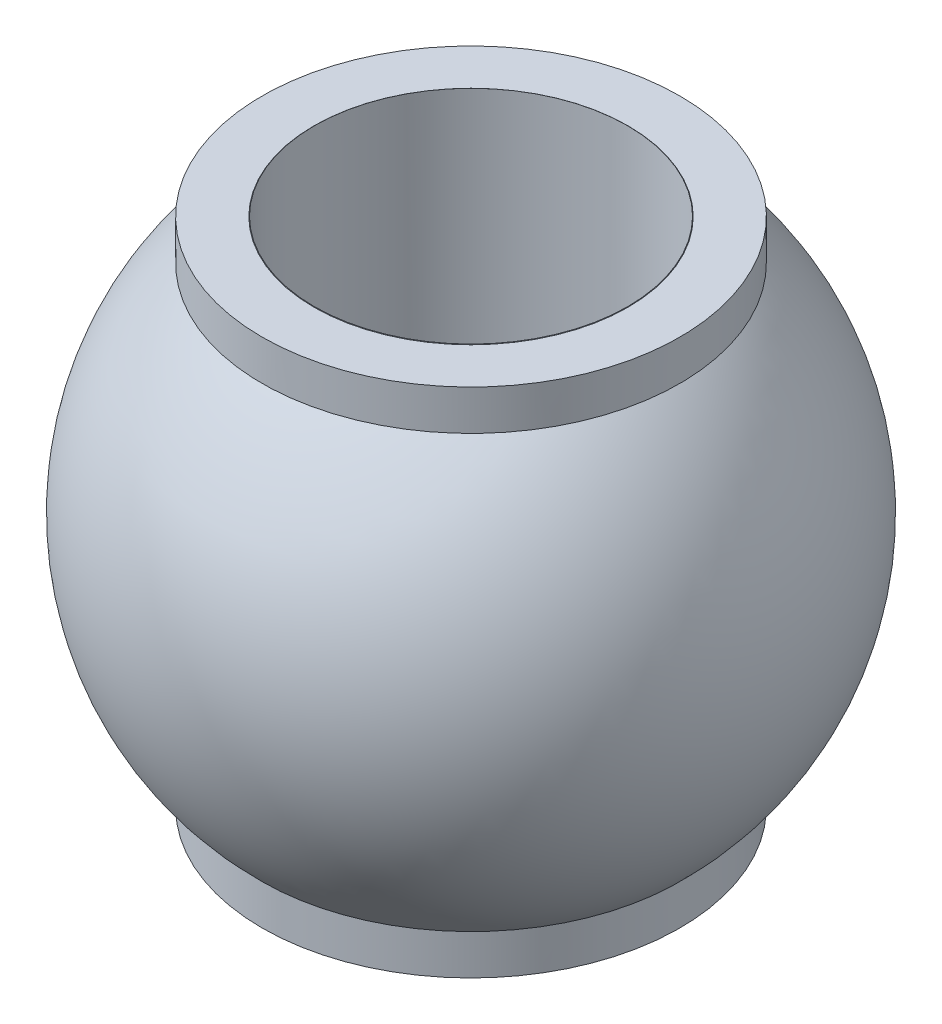
ISO-10303-21;
HEADER;
FILE_DESCRIPTION(('STEP AP214'),'2;1');
FILE_NAME('part.step','',(''),(''),'','','');
FILE_SCHEMA(('AUTOMOTIVE_DESIGN { 1 0 10303 214 1 1 1 1 }'));
ENDSEC;
DATA;
#1=APPLICATION_CONTEXT('core data for automotive mechanical design processes');
#2=APPLICATION_PROTOCOL_DEFINITION('international standard','automotive_design',2000,#1);
#3=PRODUCT_CONTEXT('',#1,'mechanical');
#4=PRODUCT('Part','Part','',(#3));
#5=PRODUCT_RELATED_PRODUCT_CATEGORY('part','',(#4));
#6=PRODUCT_DEFINITION_FORMATION('','',#4);
#7=PRODUCT_DEFINITION_CONTEXT('part definition',#1,'design');
#8=PRODUCT_DEFINITION('design','',#6,#7);
#9=PRODUCT_DEFINITION_SHAPE('','',#8);
#10=(LENGTH_UNIT() NAMED_UNIT(*) SI_UNIT(.MILLI.,.METRE.));
#11=(NAMED_UNIT(*) PLANE_ANGLE_UNIT() SI_UNIT($,.RADIAN.));
#12=(NAMED_UNIT(*) SI_UNIT($,.STERADIAN.) SOLID_ANGLE_UNIT());
#13=UNCERTAINTY_MEASURE_WITH_UNIT(LENGTH_MEASURE(1.E-05),#10,'distance_accuracy_value','');
#14=(GEOMETRIC_REPRESENTATION_CONTEXT(3) GLOBAL_UNCERTAINTY_ASSIGNED_CONTEXT((#13)) GLOBAL_UNIT_ASSIGNED_CONTEXT((#10,
#11,#12)) REPRESENTATION_CONTEXT('',''));
#15=CARTESIAN_POINT('',(0.,0.,0.));
#16=DIRECTION('',(0.,0.,1.));
#17=DIRECTION('',(1.,0.,0.));
#18=AXIS2_PLACEMENT_3D('',#15,#16,#17);
#19=CARTESIAN_POINT('',(0.,0.,0.));
#20=DIRECTION('',(0.,1.,0.));
#21=DIRECTION('',(1.,0.,0.));
#22=AXIS2_PLACEMENT_3D('',#19,#20,#21);
#23=SPHERICAL_SURFACE('',#22,2.875);
#24=CARTESIAN_POINT('',(0.,2.45267710879357,0.));
#25=DIRECTION('',(0.,-1.,0.));
#26=DIRECTION('',(0.,0.,-1.));
#27=AXIS2_PLACEMENT_3D('',#24,#25,#26);
#28=CIRCLE('',#27,1.5);
#29=CARTESIAN_POINT('',(0.,2.45267710879357,-1.5));
#30=VERTEX_POINT('',#29);
#31=EDGE_CURVE('E62',#30,#30,#28,.F.);
#32=ORIENTED_EDGE('',*,*,#31,.F.);
#33=EDGE_LOOP('',(#32));
#34=FACE_BOUND('',#33,.T.);
#35=CARTESIAN_POINT('',(0.,2.45,0.));
#36=DIRECTION('',(0.,1.,0.));
#37=DIRECTION('',(0.,0.,1.));
#38=AXIS2_PLACEMENT_3D('',#35,#36,#37);
#39=CIRCLE('',#38,1.50436863833304);
#40=CARTESIAN_POINT('',(0.,2.45,1.50436863833304));
#41=VERTEX_POINT('',#40);
#42=EDGE_CURVE('E10',#41,#41,#39,.F.);
#43=ORIENTED_EDGE('',*,*,#42,.F.);
#44=EDGE_LOOP('',(#43));
#45=FACE_BOUND('',#44,.T.);
#46=ADVANCED_FACE('F39',(#34,#45),#23,.T.);
#47=CARTESIAN_POINT('',(0.,2.45,0.));
#48=DIRECTION('',(0.,-1.,0.));
#49=DIRECTION('',(0.,0.,-1.));
#50=AXIS2_PLACEMENT_3D('',#47,#48,#49);
#51=CYLINDRICAL_SURFACE('',#50,2.);
#52=CARTESIAN_POINT('',(0.,2.06533895523229,0.));
#53=DIRECTION('',(0.,-1.,0.));
#54=DIRECTION('',(0.,0.,-1.));
#55=AXIS2_PLACEMENT_3D('',#52,#53,#54);
#56=CIRCLE('',#55,2.);
#57=CARTESIAN_POINT('',(0.,2.06533895523229,-2.));
#58=VERTEX_POINT('',#57);
#59=EDGE_CURVE('E55',#58,#58,#56,.T.);
#60=ORIENTED_EDGE('',*,*,#59,.F.);
#61=EDGE_LOOP('',(#60));
#62=FACE_BOUND('',#61,.T.);
#63=CARTESIAN_POINT('',(0.,2.45,0.));
#64=DIRECTION('',(0.,1.,0.));
#65=DIRECTION('',(0.,0.,1.));
#66=AXIS2_PLACEMENT_3D('',#63,#64,#65);
#67=CIRCLE('',#66,2.);
#68=CARTESIAN_POINT('',(0.,2.45,2.));
#69=VERTEX_POINT('',#68);
#70=EDGE_CURVE('E58',#69,#69,#67,.T.);
#71=ORIENTED_EDGE('',*,*,#70,.F.);
#72=EDGE_LOOP('',(#71));
#73=FACE_BOUND('',#72,.T.);
#74=ADVANCED_FACE('F88',(#62,#73),#51,.T.);
#75=CARTESIAN_POINT('',(0.,2.45,0.));
#76=DIRECTION('',(0.,1.,0.));
#77=DIRECTION('',(0.,0.,1.));
#78=AXIS2_PLACEMENT_3D('',#75,#76,#77);
#79=PLANE('',#78);
#80=ORIENTED_EDGE('',*,*,#42,.T.);
#81=EDGE_LOOP('',(#80));
#82=FACE_BOUND('',#81,.T.);
#83=ORIENTED_EDGE('',*,*,#70,.T.);
#84=EDGE_LOOP('',(#83));
#85=FACE_BOUND('',#84,.T.);
#86=ADVANCED_FACE('F92',(#82,#85),#79,.T.);
#87=ORIENTED_EDGE('',*,*,#59,.T.);
#88=EDGE_LOOP('',(#87));
#89=FACE_BOUND('',#88,.T.);
#90=CARTESIAN_POINT('',(0.,-2.06533895523229,0.));
#91=DIRECTION('',(0.,1.,0.));
#92=DIRECTION('',(0.,0.,1.));
#93=AXIS2_PLACEMENT_3D('',#90,#91,#92);
#94=CIRCLE('',#93,2.);
#95=CARTESIAN_POINT('',(0.,-2.06533895523229,2.));
#96=VERTEX_POINT('',#95);
#97=EDGE_CURVE('E50',#96,#96,#94,.T.);
#98=ORIENTED_EDGE('',*,*,#97,.T.);
#99=EDGE_LOOP('',(#98));
#100=FACE_BOUND('',#99,.T.);
#101=ADVANCED_FACE('F77',(#89,#100),#23,.T.);
#102=ORIENTED_EDGE('',*,*,#97,.F.);
#103=EDGE_LOOP('',(#102));
#104=FACE_BOUND('',#103,.T.);
#105=CARTESIAN_POINT('',(0.,-2.45,0.));
#106=DIRECTION('',(0.,1.,0.));
#107=DIRECTION('',(0.,0.,1.));
#108=AXIS2_PLACEMENT_3D('',#105,#106,#107);
#109=CIRCLE('',#108,2.);
#110=CARTESIAN_POINT('',(0.,-2.45,2.));
#111=VERTEX_POINT('',#110);
#112=EDGE_CURVE('E59',#111,#111,#109,.T.);
#113=ORIENTED_EDGE('',*,*,#112,.T.);
#114=EDGE_LOOP('',(#113));
#115=FACE_BOUND('',#114,.T.);
#116=ADVANCED_FACE('F82',(#104,#115),#51,.T.);
#117=CARTESIAN_POINT('',(0.,-2.45,0.));
#118=DIRECTION('',(0.,1.,0.));
#119=DIRECTION('',(0.,0.,1.));
#120=AXIS2_PLACEMENT_3D('',#117,#118,#119);
#121=PLANE('',#120);
#122=CARTESIAN_POINT('',(0.,-2.45,0.));
#123=DIRECTION('',(0.,1.,0.));
#124=DIRECTION('',(0.,0.,1.));
#125=AXIS2_PLACEMENT_3D('',#122,#123,#124);
#126=CIRCLE('',#125,1.50436863833304);
#127=CARTESIAN_POINT('',(0.,-2.45,1.50436863833304));
#128=VERTEX_POINT('',#127);
#129=EDGE_CURVE('E46',#128,#128,#126,.F.);
#130=ORIENTED_EDGE('',*,*,#129,.F.);
#131=EDGE_LOOP('',(#130));
#132=FACE_BOUND('',#131,.T.);
#133=ORIENTED_EDGE('',*,*,#112,.F.);
#134=EDGE_LOOP('',(#133));
#135=FACE_BOUND('',#134,.T.);
#136=ADVANCED_FACE('F76',(#132,#135),#121,.F.);
#137=CARTESIAN_POINT('',(0.,-2.45267710879357,0.));
#138=DIRECTION('',(0.,1.,0.));
#139=DIRECTION('',(0.,0.,1.));
#140=AXIS2_PLACEMENT_3D('',#137,#138,#139);
#141=CIRCLE('',#140,1.5);
#142=CARTESIAN_POINT('',(0.,-2.45267710879357,1.5));
#143=VERTEX_POINT('',#142);
#144=EDGE_CURVE('E42',#143,#143,#141,.F.);
#145=ORIENTED_EDGE('',*,*,#144,.F.);
#146=EDGE_LOOP('',(#145));
#147=FACE_BOUND('',#146,.T.);
#148=ORIENTED_EDGE('',*,*,#129,.T.);
#149=EDGE_LOOP('',(#148));
#150=FACE_BOUND('',#149,.T.);
#151=ADVANCED_FACE('F73',(#147,#150),#23,.T.);
#152=CARTESIAN_POINT('',(0.,-3.,0.));
#153=DIRECTION('',(0.,1.,0.));
#154=DIRECTION('',(0.,0.,1.));
#155=AXIS2_PLACEMENT_3D('',#152,#153,#154);
#156=CYLINDRICAL_SURFACE('',#155,1.5);
#157=ORIENTED_EDGE('',*,*,#31,.T.);
#158=EDGE_LOOP('',(#157));
#159=FACE_BOUND('',#158,.T.);
#160=ORIENTED_EDGE('',*,*,#144,.T.);
#161=EDGE_LOOP('',(#160));
#162=FACE_BOUND('',#161,.T.);
#163=ADVANCED_FACE('F71',(#159,#162),#156,.F.);
#164=CLOSED_SHELL('',(#46,#74,#86,#101,#116,#136,#151,#163));
#165=MANIFOLD_SOLID_BREP('B2',#164);
#166=ADVANCED_BREP_SHAPE_REPRESENTATION('',(#18,#165),#14);
#167=SHAPE_DEFINITION_REPRESENTATION(#9,#166);
ENDSEC;
END-ISO-10303-21;
